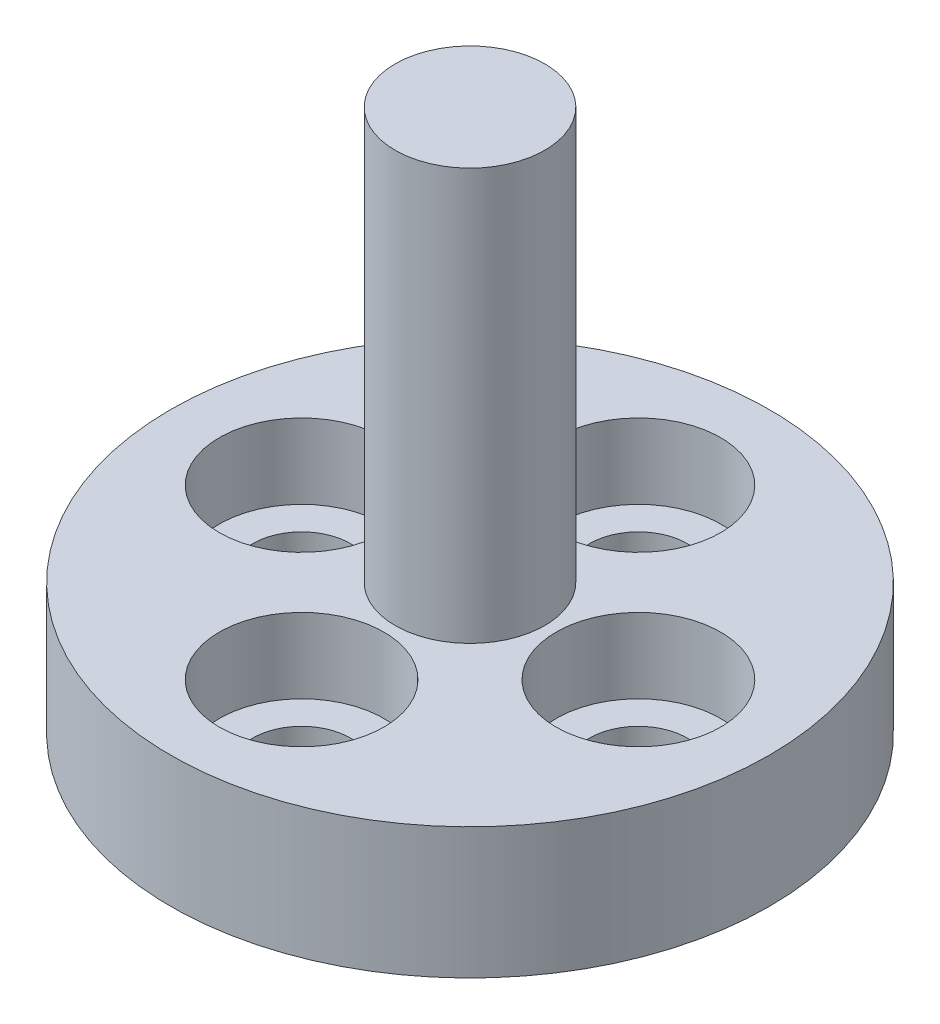
ISO-10303-21;
HEADER;
FILE_DESCRIPTION(('STEP AP214'),'2;1');
FILE_NAME('part.step','',(''),(''),'','','');
FILE_SCHEMA(('AUTOMOTIVE_DESIGN { 1 0 10303 214 1 1 1 1 }'));
ENDSEC;
DATA;
#1=APPLICATION_CONTEXT('core data for automotive mechanical design processes');
#2=APPLICATION_PROTOCOL_DEFINITION('international standard','automotive_design',2000,#1);
#3=PRODUCT_CONTEXT('',#1,'mechanical');
#4=PRODUCT('Part','Part','',(#3));
#5=PRODUCT_RELATED_PRODUCT_CATEGORY('part','',(#4));
#6=PRODUCT_DEFINITION_FORMATION('','',#4);
#7=PRODUCT_DEFINITION_CONTEXT('part definition',#1,'design');
#8=PRODUCT_DEFINITION('design','',#6,#7);
#9=PRODUCT_DEFINITION_SHAPE('','',#8);
#10=(LENGTH_UNIT() NAMED_UNIT(*) SI_UNIT(.MILLI.,.METRE.));
#11=(NAMED_UNIT(*) PLANE_ANGLE_UNIT() SI_UNIT($,.RADIAN.));
#12=(NAMED_UNIT(*) SI_UNIT($,.STERADIAN.) SOLID_ANGLE_UNIT());
#13=UNCERTAINTY_MEASURE_WITH_UNIT(LENGTH_MEASURE(1.E-05),#10,'distance_accuracy_value','');
#14=(GEOMETRIC_REPRESENTATION_CONTEXT(3) GLOBAL_UNCERTAINTY_ASSIGNED_CONTEXT((#13)) GLOBAL_UNIT_ASSIGNED_CONTEXT((#10,
#11,#12)) REPRESENTATION_CONTEXT('',''));
#15=CARTESIAN_POINT('',(0.,0.,0.));
#16=DIRECTION('',(0.,0.,1.));
#17=DIRECTION('',(1.,0.,0.));
#18=AXIS2_PLACEMENT_3D('',#15,#16,#17);
#19=CARTESIAN_POINT('',(0.,0.,0.));
#20=DIRECTION('',(0.,1.,0.));
#21=DIRECTION('',(-1.,0.,0.));
#22=AXIS2_PLACEMENT_3D('',#19,#20,#21);
#23=PLANE('',#22);
#24=CARTESIAN_POINT('',(-4.5,0.,0.));
#25=DIRECTION('',(0.,1.,0.));
#26=DIRECTION('',(-1.,0.,0.));
#27=AXIS2_PLACEMENT_3D('',#24,#25,#26);
#28=CIRCLE('',#27,1.3);
#29=CARTESIAN_POINT('',(-5.8,0.,0.));
#30=VERTEX_POINT('',#29);
#31=EDGE_CURVE('E44',#30,#30,#28,.T.);
#32=ORIENTED_EDGE('',*,*,#31,.T.);
#33=EDGE_LOOP('',(#32));
#34=FACE_BOUND('',#33,.T.);
#35=CARTESIAN_POINT('',(0.,0.,-4.5));
#36=DIRECTION('',(0.,1.,0.));
#37=DIRECTION('',(-1.,0.,0.));
#38=AXIS2_PLACEMENT_3D('',#35,#36,#37);
#39=CIRCLE('',#38,1.3);
#40=CARTESIAN_POINT('',(-1.3,0.,-4.5));
#41=VERTEX_POINT('',#40);
#42=EDGE_CURVE('E66',#41,#41,#39,.T.);
#43=ORIENTED_EDGE('',*,*,#42,.T.);
#44=EDGE_LOOP('',(#43));
#45=FACE_BOUND('',#44,.T.);
#46=CARTESIAN_POINT('',(4.5,0.,0.));
#47=DIRECTION('',(0.,1.,0.));
#48=DIRECTION('',(-1.,0.,0.));
#49=AXIS2_PLACEMENT_3D('',#46,#47,#48);
#50=CIRCLE('',#49,1.3);
#51=CARTESIAN_POINT('',(3.2,0.,0.));
#52=VERTEX_POINT('',#51);
#53=EDGE_CURVE('E62',#52,#52,#50,.T.);
#54=ORIENTED_EDGE('',*,*,#53,.T.);
#55=EDGE_LOOP('',(#54));
#56=FACE_BOUND('',#55,.T.);
#57=CARTESIAN_POINT('',(0.,0.,4.5));
#58=DIRECTION('',(0.,1.,0.));
#59=DIRECTION('',(-1.,0.,0.));
#60=AXIS2_PLACEMENT_3D('',#57,#58,#59);
#61=CIRCLE('',#60,1.3);
#62=CARTESIAN_POINT('',(-1.3,0.,4.5));
#63=VERTEX_POINT('',#62);
#64=EDGE_CURVE('E57',#63,#63,#61,.T.);
#65=ORIENTED_EDGE('',*,*,#64,.T.);
#66=EDGE_LOOP('',(#65));
#67=FACE_BOUND('',#66,.T.);
#68=CARTESIAN_POINT('',(0.,0.,0.));
#69=DIRECTION('',(0.,1.,0.));
#70=DIRECTION('',(-1.,0.,0.));
#71=AXIS2_PLACEMENT_3D('',#68,#69,#70);
#72=CIRCLE('',#71,8.);
#73=CARTESIAN_POINT('',(-8.,0.,0.));
#74=VERTEX_POINT('',#73);
#75=EDGE_CURVE('E10',#74,#74,#72,.T.);
#76=ORIENTED_EDGE('',*,*,#75,.F.);
#77=EDGE_LOOP('',(#76));
#78=FACE_BOUND('',#77,.T.);
#79=ADVANCED_FACE('F41',(#34,#45,#56,#67,#78),#23,.F.);
#80=CARTESIAN_POINT('',(0.,14.5,0.));
#81=DIRECTION('',(0.,1.,0.));
#82=DIRECTION('',(-1.,0.,0.));
#83=AXIS2_PLACEMENT_3D('',#80,#81,#82);
#84=CYLINDRICAL_SURFACE('',#83,8.);
#85=CARTESIAN_POINT('',(0.,3.5,0.));
#86=DIRECTION('',(0.,1.,0.));
#87=DIRECTION('',(-1.,0.,0.));
#88=AXIS2_PLACEMENT_3D('',#85,#86,#87);
#89=CIRCLE('',#88,8.);
#90=CARTESIAN_POINT('',(-8.,3.5,0.));
#91=VERTEX_POINT('',#90);
#92=EDGE_CURVE('E48',#91,#91,#89,.T.);
#93=ORIENTED_EDGE('',*,*,#92,.F.);
#94=EDGE_LOOP('',(#93));
#95=FACE_BOUND('',#94,.T.);
#96=ORIENTED_EDGE('',*,*,#75,.T.);
#97=EDGE_LOOP('',(#96));
#98=FACE_BOUND('',#97,.T.);
#99=ADVANCED_FACE('F105',(#95,#98),#84,.T.);
#100=CARTESIAN_POINT('',(8.,3.5,0.));
#101=DIRECTION('',(0.,-1.,0.));
#102=DIRECTION('',(1.,0.,0.));
#103=AXIS2_PLACEMENT_3D('',#100,#101,#102);
#104=PLANE('',#103);
#105=CARTESIAN_POINT('',(-4.5,3.5,0.));
#106=DIRECTION('',(0.,1.,0.));
#107=DIRECTION('',(0.,0.,1.));
#108=AXIS2_PLACEMENT_3D('',#105,#106,#107);
#109=CIRCLE('',#108,2.19999999999999);
#110=CARTESIAN_POINT('',(-4.5,3.5,2.19999999999999));
#111=VERTEX_POINT('',#110);
#112=EDGE_CURVE('E177',#111,#111,#109,.T.);
#113=ORIENTED_EDGE('',*,*,#112,.F.);
#114=EDGE_LOOP('',(#113));
#115=FACE_BOUND('',#114,.T.);
#116=CARTESIAN_POINT('',(0.,3.5,-4.5));
#117=DIRECTION('',(0.,1.,0.));
#118=DIRECTION('',(0.,0.,1.));
#119=AXIS2_PLACEMENT_3D('',#116,#117,#118);
#120=CIRCLE('',#119,2.19999999999999);
#121=CARTESIAN_POINT('',(0.,3.5,-2.30000000000001));
#122=VERTEX_POINT('',#121);
#123=EDGE_CURVE('E81',#122,#122,#120,.T.);
#124=ORIENTED_EDGE('',*,*,#123,.F.);
#125=EDGE_LOOP('',(#124));
#126=FACE_BOUND('',#125,.T.);
#127=CARTESIAN_POINT('',(4.5,3.5,0.));
#128=DIRECTION('',(0.,1.,0.));
#129=DIRECTION('',(0.,0.,1.));
#130=AXIS2_PLACEMENT_3D('',#127,#128,#129);
#131=CIRCLE('',#130,2.19999999999999);
#132=CARTESIAN_POINT('',(4.5,3.5,2.19999999999999));
#133=VERTEX_POINT('',#132);
#134=EDGE_CURVE('E68',#133,#133,#131,.T.);
#135=ORIENTED_EDGE('',*,*,#134,.F.);
#136=EDGE_LOOP('',(#135));
#137=FACE_BOUND('',#136,.T.);
#138=CARTESIAN_POINT('',(0.,3.5,4.5));
#139=DIRECTION('',(0.,1.,0.));
#140=DIRECTION('',(0.,0.,1.));
#141=AXIS2_PLACEMENT_3D('',#138,#139,#140);
#142=CIRCLE('',#141,2.19999999999999);
#143=CARTESIAN_POINT('',(0.,3.5,6.69999999999999));
#144=VERTEX_POINT('',#143);
#145=EDGE_CURVE('E64',#144,#144,#142,.T.);
#146=ORIENTED_EDGE('',*,*,#145,.F.);
#147=EDGE_LOOP('',(#146));
#148=FACE_BOUND('',#147,.T.);
#149=CARTESIAN_POINT('',(0.,3.5,0.));
#150=DIRECTION('',(0.,1.,0.));
#151=DIRECTION('',(-1.,0.,0.));
#152=AXIS2_PLACEMENT_3D('',#149,#150,#151);
#153=CIRCLE('',#152,2.);
#154=CARTESIAN_POINT('',(-2.,3.5,0.));
#155=VERTEX_POINT('',#154);
#156=EDGE_CURVE('E53',#155,#155,#153,.T.);
#157=ORIENTED_EDGE('',*,*,#156,.F.);
#158=EDGE_LOOP('',(#157));
#159=FACE_BOUND('',#158,.T.);
#160=ORIENTED_EDGE('',*,*,#92,.T.);
#161=EDGE_LOOP('',(#160));
#162=FACE_BOUND('',#161,.T.);
#163=ADVANCED_FACE('F102',(#115,#126,#137,#148,#159,#162),#104,.F.);
#164=CARTESIAN_POINT('',(0.,14.5,0.));
#165=DIRECTION('',(0.,1.,0.));
#166=DIRECTION('',(-1.,0.,0.));
#167=AXIS2_PLACEMENT_3D('',#164,#165,#166);
#168=CYLINDRICAL_SURFACE('',#167,2.);
#169=CARTESIAN_POINT('',(0.,14.5,0.));
#170=DIRECTION('',(0.,1.,0.));
#171=DIRECTION('',(-1.,0.,0.));
#172=AXIS2_PLACEMENT_3D('',#169,#170,#171);
#173=CIRCLE('',#172,2.);
#174=CARTESIAN_POINT('',(-2.,14.5,0.));
#175=VERTEX_POINT('',#174);
#176=EDGE_CURVE('E60',#175,#175,#173,.T.);
#177=ORIENTED_EDGE('',*,*,#176,.F.);
#178=EDGE_LOOP('',(#177));
#179=FACE_BOUND('',#178,.T.);
#180=ORIENTED_EDGE('',*,*,#156,.T.);
#181=EDGE_LOOP('',(#180));
#182=FACE_BOUND('',#181,.T.);
#183=ADVANCED_FACE('F100',(#179,#182),#168,.T.);
#184=CARTESIAN_POINT('',(2.,14.5,0.));
#185=DIRECTION('',(0.,-1.,0.));
#186=DIRECTION('',(1.,0.,0.));
#187=AXIS2_PLACEMENT_3D('',#184,#185,#186);
#188=PLANE('',#187);
#189=ORIENTED_EDGE('',*,*,#176,.T.);
#190=EDGE_LOOP('',(#189));
#191=FACE_BOUND('',#190,.T.);
#192=ADVANCED_FACE('F118',(#191),#188,.F.);
#193=CARTESIAN_POINT('',(0.,3.5,4.5));
#194=DIRECTION('',(0.,1.,0.));
#195=DIRECTION('',(0.,0.,1.));
#196=AXIS2_PLACEMENT_3D('',#193,#194,#195);
#197=CYLINDRICAL_SURFACE('',#196,1.3);
#198=CARTESIAN_POINT('',(0.,1.5,4.5));
#199=DIRECTION('',(0.,1.,0.));
#200=DIRECTION('',(0.,0.,1.));
#201=AXIS2_PLACEMENT_3D('',#198,#199,#200);
#202=CIRCLE('',#201,1.3);
#203=CARTESIAN_POINT('',(0.,1.5,5.8));
#204=VERTEX_POINT('',#203);
#205=EDGE_CURVE('E61',#204,#204,#202,.T.);
#206=ORIENTED_EDGE('',*,*,#205,.T.);
#207=EDGE_LOOP('',(#206));
#208=FACE_BOUND('',#207,.T.);
#209=ORIENTED_EDGE('',*,*,#64,.F.);
#210=EDGE_LOOP('',(#209));
#211=FACE_BOUND('',#210,.T.);
#212=ADVANCED_FACE('F122',(#208,#211),#197,.F.);
#213=CARTESIAN_POINT('',(1.3,1.5,4.5));
#214=DIRECTION('',(0.,-1.,0.));
#215=DIRECTION('',(0.,0.,-1.));
#216=AXIS2_PLACEMENT_3D('',#213,#214,#215);
#217=PLANE('',#216);
#218=ORIENTED_EDGE('',*,*,#205,.F.);
#219=EDGE_LOOP('',(#218));
#220=FACE_BOUND('',#219,.T.);
#221=CARTESIAN_POINT('',(0.,1.5,4.5));
#222=DIRECTION('',(0.,1.,0.));
#223=DIRECTION('',(0.,0.,1.));
#224=AXIS2_PLACEMENT_3D('',#221,#222,#223);
#225=CIRCLE('',#224,2.2);
#226=CARTESIAN_POINT('',(0.,1.5,6.7));
#227=VERTEX_POINT('',#226);
#228=EDGE_CURVE('E91',#227,#227,#225,.T.);
#229=ORIENTED_EDGE('',*,*,#228,.T.);
#230=EDGE_LOOP('',(#229));
#231=FACE_BOUND('',#230,.T.);
#232=ADVANCED_FACE('F126',(#220,#231),#217,.F.);
#233=CARTESIAN_POINT('',(0.,3.5,4.5));
#234=DIRECTION('',(0.,1.,0.));
#235=DIRECTION('',(0.,0.,1.));
#236=AXIS2_PLACEMENT_3D('',#233,#234,#235);
#237=CYLINDRICAL_SURFACE('',#236,2.19999999999999);
#238=ORIENTED_EDGE('',*,*,#228,.F.);
#239=EDGE_LOOP('',(#238));
#240=FACE_BOUND('',#239,.T.);
#241=ORIENTED_EDGE('',*,*,#145,.T.);
#242=EDGE_LOOP('',(#241));
#243=FACE_BOUND('',#242,.T.);
#244=ADVANCED_FACE('F130',(#240,#243),#237,.F.);
#245=CARTESIAN_POINT('',(4.5,3.5,0.));
#246=DIRECTION('',(0.,1.,0.));
#247=DIRECTION('',(0.,0.,1.));
#248=AXIS2_PLACEMENT_3D('',#245,#246,#247);
#249=CYLINDRICAL_SURFACE('',#248,1.3);
#250=CARTESIAN_POINT('',(4.5,1.5,0.));
#251=DIRECTION('',(0.,1.,0.));
#252=DIRECTION('',(0.,0.,1.));
#253=AXIS2_PLACEMENT_3D('',#250,#251,#252);
#254=CIRCLE('',#253,1.3);
#255=CARTESIAN_POINT('',(4.5,1.5,1.3));
#256=VERTEX_POINT('',#255);
#257=EDGE_CURVE('E65',#256,#256,#254,.T.);
#258=ORIENTED_EDGE('',*,*,#257,.T.);
#259=EDGE_LOOP('',(#258));
#260=FACE_BOUND('',#259,.T.);
#261=ORIENTED_EDGE('',*,*,#53,.F.);
#262=EDGE_LOOP('',(#261));
#263=FACE_BOUND('',#262,.T.);
#264=ADVANCED_FACE('F134',(#260,#263),#249,.F.);
#265=CARTESIAN_POINT('',(5.8,1.5,0.));
#266=DIRECTION('',(0.,-1.,0.));
#267=DIRECTION('',(0.,0.,-1.));
#268=AXIS2_PLACEMENT_3D('',#265,#266,#267);
#269=PLANE('',#268);
#270=ORIENTED_EDGE('',*,*,#257,.F.);
#271=EDGE_LOOP('',(#270));
#272=FACE_BOUND('',#271,.T.);
#273=CARTESIAN_POINT('',(4.5,1.5,0.));
#274=DIRECTION('',(0.,1.,0.));
#275=DIRECTION('',(0.,0.,1.));
#276=AXIS2_PLACEMENT_3D('',#273,#274,#275);
#277=CIRCLE('',#276,2.2);
#278=CARTESIAN_POINT('',(4.5,1.5,2.2));
#279=VERTEX_POINT('',#278);
#280=EDGE_CURVE('E73',#279,#279,#277,.T.);
#281=ORIENTED_EDGE('',*,*,#280,.T.);
#282=EDGE_LOOP('',(#281));
#283=FACE_BOUND('',#282,.T.);
#284=ADVANCED_FACE('F138',(#272,#283),#269,.F.);
#285=CARTESIAN_POINT('',(4.5,3.5,0.));
#286=DIRECTION('',(0.,1.,0.));
#287=DIRECTION('',(0.,0.,1.));
#288=AXIS2_PLACEMENT_3D('',#285,#286,#287);
#289=CYLINDRICAL_SURFACE('',#288,2.19999999999999);
#290=ORIENTED_EDGE('',*,*,#280,.F.);
#291=EDGE_LOOP('',(#290));
#292=FACE_BOUND('',#291,.T.);
#293=ORIENTED_EDGE('',*,*,#134,.T.);
#294=EDGE_LOOP('',(#293));
#295=FACE_BOUND('',#294,.T.);
#296=ADVANCED_FACE('F142',(#292,#295),#289,.F.);
#297=CARTESIAN_POINT('',(0.,3.5,-4.5));
#298=DIRECTION('',(0.,1.,0.));
#299=DIRECTION('',(0.,0.,1.));
#300=AXIS2_PLACEMENT_3D('',#297,#298,#299);
#301=CYLINDRICAL_SURFACE('',#300,1.3);
#302=CARTESIAN_POINT('',(0.,1.5,-4.5));
#303=DIRECTION('',(0.,1.,0.));
#304=DIRECTION('',(0.,0.,1.));
#305=AXIS2_PLACEMENT_3D('',#302,#303,#304);
#306=CIRCLE('',#305,1.3);
#307=CARTESIAN_POINT('',(0.,1.5,-3.2));
#308=VERTEX_POINT('',#307);
#309=EDGE_CURVE('E69',#308,#308,#306,.T.);
#310=ORIENTED_EDGE('',*,*,#309,.T.);
#311=EDGE_LOOP('',(#310));
#312=FACE_BOUND('',#311,.T.);
#313=ORIENTED_EDGE('',*,*,#42,.F.);
#314=EDGE_LOOP('',(#313));
#315=FACE_BOUND('',#314,.T.);
#316=ADVANCED_FACE('F146',(#312,#315),#301,.F.);
#317=CARTESIAN_POINT('',(1.3,1.5,-4.5));
#318=DIRECTION('',(0.,-1.,0.));
#319=DIRECTION('',(0.,0.,-1.));
#320=AXIS2_PLACEMENT_3D('',#317,#318,#319);
#321=PLANE('',#320);
#322=ORIENTED_EDGE('',*,*,#309,.F.);
#323=EDGE_LOOP('',(#322));
#324=FACE_BOUND('',#323,.T.);
#325=CARTESIAN_POINT('',(0.,1.5,-4.5));
#326=DIRECTION('',(0.,1.,0.));
#327=DIRECTION('',(0.,0.,1.));
#328=AXIS2_PLACEMENT_3D('',#325,#326,#327);
#329=CIRCLE('',#328,2.2);
#330=CARTESIAN_POINT('',(0.,1.5,-2.3));
#331=VERTEX_POINT('',#330);
#332=EDGE_CURVE('E76',#331,#331,#329,.T.);
#333=ORIENTED_EDGE('',*,*,#332,.T.);
#334=EDGE_LOOP('',(#333));
#335=FACE_BOUND('',#334,.T.);
#336=ADVANCED_FACE('F150',(#324,#335),#321,.F.);
#337=CARTESIAN_POINT('',(0.,3.5,-4.5));
#338=DIRECTION('',(0.,1.,0.));
#339=DIRECTION('',(0.,0.,1.));
#340=AXIS2_PLACEMENT_3D('',#337,#338,#339);
#341=CYLINDRICAL_SURFACE('',#340,2.19999999999999);
#342=ORIENTED_EDGE('',*,*,#332,.F.);
#343=EDGE_LOOP('',(#342));
#344=FACE_BOUND('',#343,.T.);
#345=ORIENTED_EDGE('',*,*,#123,.T.);
#346=EDGE_LOOP('',(#345));
#347=FACE_BOUND('',#346,.T.);
#348=ADVANCED_FACE('F153',(#344,#347),#341,.F.);
#349=CARTESIAN_POINT('',(-4.5,3.5,0.));
#350=DIRECTION('',(0.,1.,0.));
#351=DIRECTION('',(0.,0.,1.));
#352=AXIS2_PLACEMENT_3D('',#349,#350,#351);
#353=CYLINDRICAL_SURFACE('',#352,1.3);
#354=CARTESIAN_POINT('',(-4.5,1.5,0.));
#355=DIRECTION('',(0.,1.,0.));
#356=DIRECTION('',(0.,0.,1.));
#357=AXIS2_PLACEMENT_3D('',#354,#355,#356);
#358=CIRCLE('',#357,1.3);
#359=CARTESIAN_POINT('',(-4.5,1.5,1.3));
#360=VERTEX_POINT('',#359);
#361=EDGE_CURVE('E179',#360,#360,#358,.T.);
#362=ORIENTED_EDGE('',*,*,#361,.T.);
#363=EDGE_LOOP('',(#362));
#364=FACE_BOUND('',#363,.T.);
#365=ORIENTED_EDGE('',*,*,#31,.F.);
#366=EDGE_LOOP('',(#365));
#367=FACE_BOUND('',#366,.T.);
#368=ADVANCED_FACE('F157',(#364,#367),#353,.F.);
#369=CARTESIAN_POINT('',(-3.2,1.5,0.));
#370=DIRECTION('',(0.,-1.,0.));
#371=DIRECTION('',(0.,0.,-1.));
#372=AXIS2_PLACEMENT_3D('',#369,#370,#371);
#373=PLANE('',#372);
#374=ORIENTED_EDGE('',*,*,#361,.F.);
#375=EDGE_LOOP('',(#374));
#376=FACE_BOUND('',#375,.T.);
#377=CARTESIAN_POINT('',(-4.5,1.5,0.));
#378=DIRECTION('',(0.,1.,0.));
#379=DIRECTION('',(0.,0.,1.));
#380=AXIS2_PLACEMENT_3D('',#377,#378,#379);
#381=CIRCLE('',#380,2.2);
#382=CARTESIAN_POINT('',(-4.5,1.5,2.2));
#383=VERTEX_POINT('',#382);
#384=EDGE_CURVE('E174',#383,#383,#381,.T.);
#385=ORIENTED_EDGE('',*,*,#384,.T.);
#386=EDGE_LOOP('',(#385));
#387=FACE_BOUND('',#386,.T.);
#388=ADVANCED_FACE('F161',(#376,#387),#373,.F.);
#389=CARTESIAN_POINT('',(-4.5,3.5,0.));
#390=DIRECTION('',(0.,1.,0.));
#391=DIRECTION('',(0.,0.,1.));
#392=AXIS2_PLACEMENT_3D('',#389,#390,#391);
#393=CYLINDRICAL_SURFACE('',#392,2.19999999999999);
#394=ORIENTED_EDGE('',*,*,#384,.F.);
#395=EDGE_LOOP('',(#394));
#396=FACE_BOUND('',#395,.T.);
#397=ORIENTED_EDGE('',*,*,#112,.T.);
#398=EDGE_LOOP('',(#397));
#399=FACE_BOUND('',#398,.T.);
#400=ADVANCED_FACE('F165',(#396,#399),#393,.F.);
#401=CLOSED_SHELL('',(#79,#99,#163,#183,#192,#212,#232,#244,#264,#284,#296,#316,#336,#348,#368,
#388,#400));
#402=MANIFOLD_SOLID_BREP('B2',#401);
#403=ADVANCED_BREP_SHAPE_REPRESENTATION('',(#18,#402),#14);
#404=SHAPE_DEFINITION_REPRESENTATION(#9,#403);
ENDSEC;
END-ISO-10303-21;
